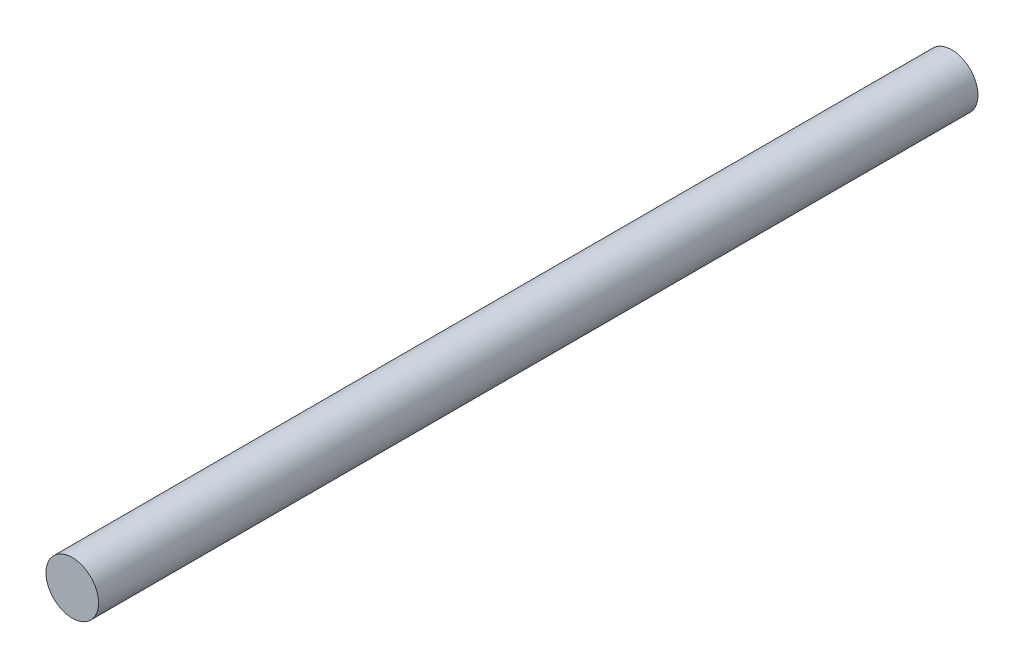
ISO-10303-21;
HEADER;
FILE_DESCRIPTION(('STEP AP214'),'2;1');
FILE_NAME('part.step','',(''),(''),'','','');
FILE_SCHEMA(('AUTOMOTIVE_DESIGN { 1 0 10303 214 1 1 1 1 }'));
ENDSEC;
DATA;
#1=APPLICATION_CONTEXT('core data for automotive mechanical design processes');
#2=APPLICATION_PROTOCOL_DEFINITION('international standard','automotive_design',2000,#1);
#3=PRODUCT_CONTEXT('',#1,'mechanical');
#4=PRODUCT('Part','Part','',(#3));
#5=PRODUCT_RELATED_PRODUCT_CATEGORY('part','',(#4));
#6=PRODUCT_DEFINITION_FORMATION('','',#4);
#7=PRODUCT_DEFINITION_CONTEXT('part definition',#1,'design');
#8=PRODUCT_DEFINITION('design','',#6,#7);
#9=PRODUCT_DEFINITION_SHAPE('','',#8);
#10=(LENGTH_UNIT() NAMED_UNIT(*) SI_UNIT(.MILLI.,.METRE.));
#11=(NAMED_UNIT(*) PLANE_ANGLE_UNIT() SI_UNIT($,.RADIAN.));
#12=(NAMED_UNIT(*) SI_UNIT($,.STERADIAN.) SOLID_ANGLE_UNIT());
#13=UNCERTAINTY_MEASURE_WITH_UNIT(LENGTH_MEASURE(1.E-05),#10,'distance_accuracy_value','');
#14=(GEOMETRIC_REPRESENTATION_CONTEXT(3) GLOBAL_UNCERTAINTY_ASSIGNED_CONTEXT((#13)) GLOBAL_UNIT_ASSIGNED_CONTEXT((#10,
#11,#12)) REPRESENTATION_CONTEXT('',''));
#15=CARTESIAN_POINT('',(0.,0.,0.));
#16=DIRECTION('',(0.,0.,1.));
#17=DIRECTION('',(1.,0.,0.));
#18=AXIS2_PLACEMENT_3D('',#15,#16,#17);
#19=CARTESIAN_POINT('',(0.,0.,133.35));
#20=DIRECTION('',(0.,0.,-1.));
#21=DIRECTION('',(-1.,0.,0.));
#22=AXIS2_PLACEMENT_3D('',#19,#20,#21);
#23=CYLINDRICAL_SURFACE('',#22,3.9878);
#24=CARTESIAN_POINT('',(0.,0.,133.35));
#25=DIRECTION('',(0.,0.,1.));
#26=DIRECTION('',(1.,0.,0.));
#27=AXIS2_PLACEMENT_3D('',#24,#25,#26);
#28=CIRCLE('',#27,3.9878);
#29=CARTESIAN_POINT('',(3.9878,0.,133.35));
#30=VERTEX_POINT('',#29);
#31=EDGE_CURVE('E10',#30,#30,#28,.T.);
#32=ORIENTED_EDGE('',*,*,#31,.F.);
#33=EDGE_LOOP('',(#32));
#34=FACE_BOUND('',#33,.T.);
#35=CARTESIAN_POINT('',(0.,0.,0.));
#36=DIRECTION('',(0.,0.,1.));
#37=DIRECTION('',(1.,0.,0.));
#38=AXIS2_PLACEMENT_3D('',#35,#36,#37);
#39=CIRCLE('',#38,3.9878);
#40=CARTESIAN_POINT('',(3.9878,0.,0.));
#41=VERTEX_POINT('',#40);
#42=EDGE_CURVE('E44',#41,#41,#39,.T.);
#43=ORIENTED_EDGE('',*,*,#42,.T.);
#44=EDGE_LOOP('',(#43));
#45=FACE_BOUND('',#44,.T.);
#46=ADVANCED_FACE('F41',(#34,#45),#23,.T.);
#47=CARTESIAN_POINT('',(0.,0.,133.35));
#48=DIRECTION('',(0.,0.,1.));
#49=DIRECTION('',(1.,0.,0.));
#50=AXIS2_PLACEMENT_3D('',#47,#48,#49);
#51=PLANE('',#50);
#52=ORIENTED_EDGE('',*,*,#31,.T.);
#53=EDGE_LOOP('',(#52));
#54=FACE_BOUND('',#53,.T.);
#55=ADVANCED_FACE('F58',(#54),#51,.T.);
#56=CARTESIAN_POINT('',(0.,0.,0.));
#57=DIRECTION('',(0.,0.,1.));
#58=DIRECTION('',(1.,0.,0.));
#59=AXIS2_PLACEMENT_3D('',#56,#57,#58);
#60=PLANE('',#59);
#61=ORIENTED_EDGE('',*,*,#42,.F.);
#62=EDGE_LOOP('',(#61));
#63=FACE_BOUND('',#62,.T.);
#64=ADVANCED_FACE('F56',(#63),#60,.F.);
#65=CLOSED_SHELL('',(#46,#55,#64));
#66=MANIFOLD_SOLID_BREP('B2',#65);
#67=ADVANCED_BREP_SHAPE_REPRESENTATION('',(#18,#66),#14);
#68=SHAPE_DEFINITION_REPRESENTATION(#9,#67);
ENDSEC;
END-ISO-10303-21;
